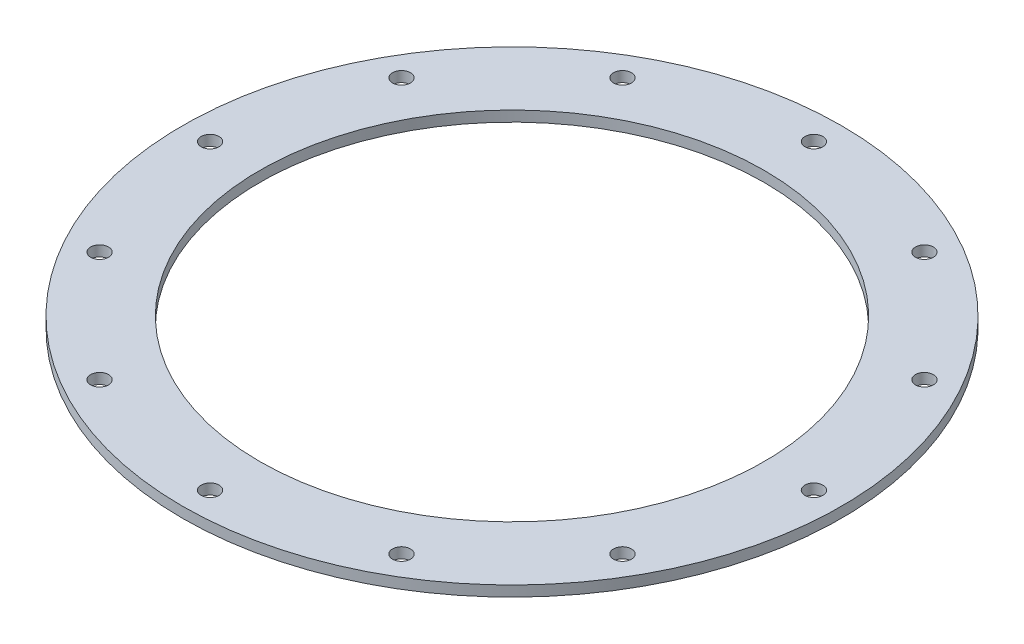
ISO-10303-21;
HEADER;
FILE_DESCRIPTION(('STEP AP214'),'2;1');
FILE_NAME('part.step','',(''),(''),'','','');
FILE_SCHEMA(('AUTOMOTIVE_DESIGN { 1 0 10303 214 1 1 1 1 }'));
ENDSEC;
DATA;
#1=APPLICATION_CONTEXT('core data for automotive mechanical design processes');
#2=APPLICATION_PROTOCOL_DEFINITION('international standard','automotive_design',2000,#1);
#3=PRODUCT_CONTEXT('',#1,'mechanical');
#4=PRODUCT('Part','Part','',(#3));
#5=PRODUCT_RELATED_PRODUCT_CATEGORY('part','',(#4));
#6=PRODUCT_DEFINITION_FORMATION('','',#4);
#7=PRODUCT_DEFINITION_CONTEXT('part definition',#1,'design');
#8=PRODUCT_DEFINITION('design','',#6,#7);
#9=PRODUCT_DEFINITION_SHAPE('','',#8);
#10=(LENGTH_UNIT() NAMED_UNIT(*) SI_UNIT(.MILLI.,.METRE.));
#11=(NAMED_UNIT(*) PLANE_ANGLE_UNIT() SI_UNIT($,.RADIAN.));
#12=(NAMED_UNIT(*) SI_UNIT($,.STERADIAN.) SOLID_ANGLE_UNIT());
#13=UNCERTAINTY_MEASURE_WITH_UNIT(LENGTH_MEASURE(1.E-05),#10,'distance_accuracy_value','');
#14=(GEOMETRIC_REPRESENTATION_CONTEXT(3) GLOBAL_UNCERTAINTY_ASSIGNED_CONTEXT((#13)) GLOBAL_UNIT_ASSIGNED_CONTEXT((#10,
#11,#12)) REPRESENTATION_CONTEXT('',''));
#15=CARTESIAN_POINT('',(0.,0.,0.));
#16=DIRECTION('',(0.,0.,1.));
#17=DIRECTION('',(1.,0.,0.));
#18=AXIS2_PLACEMENT_3D('',#15,#16,#17);
#19=CARTESIAN_POINT('',(-38.1,1.5875,0.));
#20=DIRECTION('',(0.,1.,0.));
#21=DIRECTION('',(0.,0.,1.));
#22=AXIS2_PLACEMENT_3D('',#19,#20,#21);
#23=PLANE('',#22);
#24=CARTESIAN_POINT('',(-39.4956947573722,1.58750000000001,22.8028499999996));
#25=DIRECTION('',(0.,-1.,0.));
#26=DIRECTION('',(0.,0.,-1.));
#27=AXIS2_PLACEMENT_3D('',#24,#25,#26);
#28=CIRCLE('',#27,1.35255);
#29=CARTESIAN_POINT('',(-39.4956947573722,1.58750000000001,21.4502999999996));
#30=VERTEX_POINT('',#29);
#31=EDGE_CURVE('E119',#30,#30,#28,.T.);
#32=ORIENTED_EDGE('',*,*,#31,.T.);
#33=EDGE_LOOP('',(#32));
#34=FACE_BOUND('',#33,.T.);
#35=CARTESIAN_POINT('',(-22.8028500000004,1.58750000000001,39.4956947573717));
#36=DIRECTION('',(0.,-1.,0.));
#37=DIRECTION('',(0.,0.,-1.));
#38=AXIS2_PLACEMENT_3D('',#35,#36,#37);
#39=CIRCLE('',#38,1.35255);
#40=CARTESIAN_POINT('',(-22.8028500000004,1.58750000000001,38.1431447573717));
#41=VERTEX_POINT('',#40);
#42=EDGE_CURVE('E113',#41,#41,#39,.T.);
#43=ORIENTED_EDGE('',*,*,#42,.T.);
#44=EDGE_LOOP('',(#43));
#45=FACE_BOUND('',#44,.T.);
#46=CARTESIAN_POINT('',(-3.91097266921211E-13,1.58750000000001,45.6057));
#47=DIRECTION('',(0.,-1.,0.));
#48=DIRECTION('',(0.,0.,-1.));
#49=AXIS2_PLACEMENT_3D('',#46,#47,#48);
#50=CIRCLE('',#49,1.35255);
#51=CARTESIAN_POINT('',(-3.91097266921211E-13,1.58750000000001,44.25315));
#52=VERTEX_POINT('',#51);
#53=EDGE_CURVE('E107',#52,#52,#50,.T.);
#54=ORIENTED_EDGE('',*,*,#53,.T.);
#55=EDGE_LOOP('',(#54));
#56=FACE_BOUND('',#55,.T.);
#57=CARTESIAN_POINT('',(45.6057,1.58750000000001,2.52118815703992E-13));
#58=DIRECTION('',(0.,-1.,0.));
#59=DIRECTION('',(0.,0.,-1.));
#60=AXIS2_PLACEMENT_3D('',#57,#58,#59);
#61=CIRCLE('',#60,1.35255);
#62=CARTESIAN_POINT('',(45.6057,1.58750000000001,-1.35254999999975));
#63=VERTEX_POINT('',#62);
#64=EDGE_CURVE('E89',#63,#63,#61,.T.);
#65=ORIENTED_EDGE('',*,*,#64,.T.);
#66=EDGE_LOOP('',(#65));
#67=FACE_BOUND('',#66,.T.);
#68=CARTESIAN_POINT('',(39.4956947573721,1.58750000000001,-22.8028499999998));
#69=DIRECTION('',(0.,-1.,0.));
#70=DIRECTION('',(0.,0.,-1.));
#71=AXIS2_PLACEMENT_3D('',#68,#69,#70);
#72=CIRCLE('',#71,1.35255);
#73=CARTESIAN_POINT('',(39.4956947573721,1.58750000000001,-24.1553999999998));
#74=VERTEX_POINT('',#73);
#75=EDGE_CURVE('E83',#74,#74,#72,.T.);
#76=ORIENTED_EDGE('',*,*,#75,.T.);
#77=EDGE_LOOP('',(#76));
#78=FACE_BOUND('',#77,.T.);
#79=CARTESIAN_POINT('',(22.8028500000001,1.58750000000001,-39.4956947573719));
#80=DIRECTION('',(0.,-1.,0.));
#81=DIRECTION('',(0.,0.,-1.));
#82=AXIS2_PLACEMENT_3D('',#79,#80,#81);
#83=CIRCLE('',#82,1.35255);
#84=CARTESIAN_POINT('',(22.8028500000001,1.58750000000001,-40.8482447573719));
#85=VERTEX_POINT('',#84);
#86=EDGE_CURVE('E77',#85,#85,#83,.T.);
#87=ORIENTED_EDGE('',*,*,#86,.T.);
#88=EDGE_LOOP('',(#87));
#89=FACE_BOUND('',#88,.T.);
#90=CARTESIAN_POINT('',(1.23266864125602E-13,1.58750000000001,-45.6057));
#91=DIRECTION('',(0.,-1.,0.));
#92=DIRECTION('',(0.,0.,-1.));
#93=AXIS2_PLACEMENT_3D('',#90,#91,#92);
#94=CIRCLE('',#93,1.35255);
#95=CARTESIAN_POINT('',(1.23266864125602E-13,1.58750000000001,-46.95825));
#96=VERTEX_POINT('',#95);
#97=EDGE_CURVE('E71',#96,#96,#94,.T.);
#98=ORIENTED_EDGE('',*,*,#97,.T.);
#99=EDGE_LOOP('',(#98));
#100=FACE_BOUND('',#99,.T.);
#101=CARTESIAN_POINT('',(-39.495694757372,1.58750000000001,-22.80285));
#102=DIRECTION('',(0.,-1.,0.));
#103=DIRECTION('',(0.,0.,-1.));
#104=AXIS2_PLACEMENT_3D('',#101,#102,#103);
#105=CIRCLE('',#104,1.35255);
#106=CARTESIAN_POINT('',(-39.495694757372,1.58750000000001,-24.1554));
#107=VERTEX_POINT('',#106);
#108=EDGE_CURVE('E59',#107,#107,#105,.T.);
#109=ORIENTED_EDGE('',*,*,#108,.T.);
#110=EDGE_LOOP('',(#109));
#111=FACE_BOUND('',#110,.T.);
#112=CARTESIAN_POINT('',(-45.6057,1.58750000000001,0.));
#113=DIRECTION('',(0.,-1.,0.));
#114=DIRECTION('',(0.,0.,-1.));
#115=AXIS2_PLACEMENT_3D('',#112,#113,#114);
#116=CIRCLE('',#115,1.35255);
#117=CARTESIAN_POINT('',(-45.6057,1.58750000000001,-1.35255));
#118=VERTEX_POINT('',#117);
#119=EDGE_CURVE('E53',#118,#118,#116,.T.);
#120=ORIENTED_EDGE('',*,*,#119,.T.);
#121=EDGE_LOOP('',(#120));
#122=FACE_BOUND('',#121,.T.);
#123=CARTESIAN_POINT('',(0.,1.5875,0.));
#124=DIRECTION('',(0.,1.,0.));
#125=DIRECTION('',(0.,0.,1.));
#126=AXIS2_PLACEMENT_3D('',#123,#124,#125);
#127=CIRCLE('',#126,49.784);
#128=CARTESIAN_POINT('',(0.,1.5875,49.784));
#129=VERTEX_POINT('',#128);
#130=EDGE_CURVE('E40',#129,#129,#127,.T.);
#131=ORIENTED_EDGE('',*,*,#130,.T.);
#132=EDGE_LOOP('',(#131));
#133=FACE_BOUND('',#132,.T.);
#134=CARTESIAN_POINT('',(0.,1.5875,0.));
#135=DIRECTION('',(0.,1.,0.));
#136=DIRECTION('',(0.,0.,1.));
#137=AXIS2_PLACEMENT_3D('',#134,#135,#136);
#138=CIRCLE('',#137,38.1);
#139=CARTESIAN_POINT('',(0.,1.5875,38.1));
#140=VERTEX_POINT('',#139);
#141=EDGE_CURVE('E10',#140,#140,#138,.T.);
#142=ORIENTED_EDGE('',*,*,#141,.F.);
#143=EDGE_LOOP('',(#142));
#144=FACE_BOUND('',#143,.T.);
#145=CARTESIAN_POINT('',(-22.8028499999999,1.58750000000001,-39.495694757372));
#146=DIRECTION('',(0.,-1.,0.));
#147=DIRECTION('',(0.,0.,-1.));
#148=AXIS2_PLACEMENT_3D('',#145,#146,#147);
#149=CIRCLE('',#148,1.35255);
#150=CARTESIAN_POINT('',(-22.8028499999999,1.58750000000001,-40.848244757372));
#151=VERTEX_POINT('',#150);
#152=EDGE_CURVE('E65',#151,#151,#149,.T.);
#153=ORIENTED_EDGE('',*,*,#152,.T.);
#154=EDGE_LOOP('',(#153));
#155=FACE_BOUND('',#154,.T.);
#156=CARTESIAN_POINT('',(39.4956947573718,1.58750000000001,22.8028500000002));
#157=DIRECTION('',(0.,-1.,0.));
#158=DIRECTION('',(0.,0.,-1.));
#159=AXIS2_PLACEMENT_3D('',#156,#157,#158);
#160=CIRCLE('',#159,1.35255);
#161=CARTESIAN_POINT('',(39.4956947573718,1.58750000000001,21.4503000000002));
#162=VERTEX_POINT('',#161);
#163=EDGE_CURVE('E95',#162,#162,#160,.T.);
#164=ORIENTED_EDGE('',*,*,#163,.T.);
#165=EDGE_LOOP('',(#164));
#166=FACE_BOUND('',#165,.T.);
#167=CARTESIAN_POINT('',(22.8028499999997,1.58750000000001,39.4956947573722));
#168=DIRECTION('',(0.,-1.,0.));
#169=DIRECTION('',(0.,0.,-1.));
#170=AXIS2_PLACEMENT_3D('',#167,#168,#169);
#171=CIRCLE('',#170,1.35255);
#172=CARTESIAN_POINT('',(22.8028499999997,1.58750000000001,38.1431447573722));
#173=VERTEX_POINT('',#172);
#174=EDGE_CURVE('E101',#173,#173,#171,.T.);
#175=ORIENTED_EDGE('',*,*,#174,.T.);
#176=EDGE_LOOP('',(#175));
#177=FACE_BOUND('',#176,.T.);
#178=ADVANCED_FACE('F33',(#34,#45,#56,#67,#78,#89,#100,#111,#122,#133,#144,#155,#166,#177),#23,.T.);
#179=CARTESIAN_POINT('',(0.,55.,0.));
#180=DIRECTION('',(0.,1.,0.));
#181=DIRECTION('',(0.,0.,1.));
#182=AXIS2_PLACEMENT_3D('',#179,#180,#181);
#183=CYLINDRICAL_SURFACE('',#182,38.1);
#184=ORIENTED_EDGE('',*,*,#141,.T.);
#185=EDGE_LOOP('',(#184));
#186=FACE_BOUND('',#185,.T.);
#187=CARTESIAN_POINT('',(0.,0.,0.));
#188=DIRECTION('',(0.,1.,0.));
#189=DIRECTION('',(0.,0.,1.));
#190=AXIS2_PLACEMENT_3D('',#187,#188,#189);
#191=CIRCLE('',#190,38.1);
#192=CARTESIAN_POINT('',(0.,0.,38.1));
#193=VERTEX_POINT('',#192);
#194=EDGE_CURVE('E48',#193,#193,#191,.T.);
#195=ORIENTED_EDGE('',*,*,#194,.F.);
#196=EDGE_LOOP('',(#195));
#197=FACE_BOUND('',#196,.T.);
#198=ADVANCED_FACE('F35',(#186,#197),#183,.F.);
#199=CARTESIAN_POINT('',(0.,55.,0.));
#200=DIRECTION('',(0.,1.,0.));
#201=DIRECTION('',(0.,0.,1.));
#202=AXIS2_PLACEMENT_3D('',#199,#200,#201);
#203=CYLINDRICAL_SURFACE('',#202,49.784);
#204=CARTESIAN_POINT('',(0.,0.,0.));
#205=DIRECTION('',(0.,1.,0.));
#206=DIRECTION('',(0.,0.,1.));
#207=AXIS2_PLACEMENT_3D('',#204,#205,#206);
#208=CIRCLE('',#207,49.784);
#209=CARTESIAN_POINT('',(0.,0.,49.784));
#210=VERTEX_POINT('',#209);
#211=EDGE_CURVE('E44',#210,#210,#208,.T.);
#212=ORIENTED_EDGE('',*,*,#211,.T.);
#213=EDGE_LOOP('',(#212));
#214=FACE_BOUND('',#213,.T.);
#215=ORIENTED_EDGE('',*,*,#130,.F.);
#216=EDGE_LOOP('',(#215));
#217=FACE_BOUND('',#216,.T.);
#218=ADVANCED_FACE('F132',(#214,#217),#203,.T.);
#219=CARTESIAN_POINT('',(-38.1,0.,0.));
#220=DIRECTION('',(0.,-1.,0.));
#221=DIRECTION('',(0.,0.,-1.));
#222=AXIS2_PLACEMENT_3D('',#219,#220,#221);
#223=PLANE('',#222);
#224=CARTESIAN_POINT('',(-39.4956947573722,0.,22.8028499999996));
#225=DIRECTION('',(0.,-1.,0.));
#226=DIRECTION('',(0.,0.,-1.));
#227=AXIS2_PLACEMENT_3D('',#224,#225,#226);
#228=CIRCLE('',#227,1.35255);
#229=CARTESIAN_POINT('',(-39.4956947573722,0.,21.4502999999996));
#230=VERTEX_POINT('',#229);
#231=EDGE_CURVE('E122',#230,#230,#228,.T.);
#232=ORIENTED_EDGE('',*,*,#231,.F.);
#233=EDGE_LOOP('',(#232));
#234=FACE_BOUND('',#233,.T.);
#235=CARTESIAN_POINT('',(-22.8028500000004,0.,39.4956947573717));
#236=DIRECTION('',(0.,-1.,0.));
#237=DIRECTION('',(0.,0.,-1.));
#238=AXIS2_PLACEMENT_3D('',#235,#236,#237);
#239=CIRCLE('',#238,1.35255);
#240=CARTESIAN_POINT('',(-22.8028500000004,0.,38.1431447573717));
#241=VERTEX_POINT('',#240);
#242=EDGE_CURVE('E116',#241,#241,#239,.T.);
#243=ORIENTED_EDGE('',*,*,#242,.F.);
#244=EDGE_LOOP('',(#243));
#245=FACE_BOUND('',#244,.T.);
#246=CARTESIAN_POINT('',(-3.91097266921211E-13,0.,45.6057));
#247=DIRECTION('',(0.,-1.,0.));
#248=DIRECTION('',(0.,0.,-1.));
#249=AXIS2_PLACEMENT_3D('',#246,#247,#248);
#250=CIRCLE('',#249,1.35255);
#251=CARTESIAN_POINT('',(-3.91097266921211E-13,0.,44.25315));
#252=VERTEX_POINT('',#251);
#253=EDGE_CURVE('E110',#252,#252,#250,.T.);
#254=ORIENTED_EDGE('',*,*,#253,.F.);
#255=EDGE_LOOP('',(#254));
#256=FACE_BOUND('',#255,.T.);
#257=CARTESIAN_POINT('',(22.8028499999997,0.,39.4956947573722));
#258=DIRECTION('',(0.,-1.,0.));
#259=DIRECTION('',(0.,0.,-1.));
#260=AXIS2_PLACEMENT_3D('',#257,#258,#259);
#261=CIRCLE('',#260,1.35255);
#262=CARTESIAN_POINT('',(22.8028499999997,0.,38.1431447573722));
#263=VERTEX_POINT('',#262);
#264=EDGE_CURVE('E104',#263,#263,#261,.T.);
#265=ORIENTED_EDGE('',*,*,#264,.F.);
#266=EDGE_LOOP('',(#265));
#267=FACE_BOUND('',#266,.T.);
#268=CARTESIAN_POINT('',(39.4956947573718,0.,22.8028500000002));
#269=DIRECTION('',(0.,-1.,0.));
#270=DIRECTION('',(0.,0.,-1.));
#271=AXIS2_PLACEMENT_3D('',#268,#269,#270);
#272=CIRCLE('',#271,1.35255);
#273=CARTESIAN_POINT('',(39.4956947573718,0.,21.4503000000002));
#274=VERTEX_POINT('',#273);
#275=EDGE_CURVE('E98',#274,#274,#272,.T.);
#276=ORIENTED_EDGE('',*,*,#275,.F.);
#277=EDGE_LOOP('',(#276));
#278=FACE_BOUND('',#277,.T.);
#279=CARTESIAN_POINT('',(45.6057,0.,2.52118815703992E-13));
#280=DIRECTION('',(0.,-1.,0.));
#281=DIRECTION('',(0.,0.,-1.));
#282=AXIS2_PLACEMENT_3D('',#279,#280,#281);
#283=CIRCLE('',#282,1.35255);
#284=CARTESIAN_POINT('',(45.6057,0.,-1.35254999999975));
#285=VERTEX_POINT('',#284);
#286=EDGE_CURVE('E92',#285,#285,#283,.T.);
#287=ORIENTED_EDGE('',*,*,#286,.F.);
#288=EDGE_LOOP('',(#287));
#289=FACE_BOUND('',#288,.T.);
#290=CARTESIAN_POINT('',(39.4956947573721,0.,-22.8028499999998));
#291=DIRECTION('',(0.,-1.,0.));
#292=DIRECTION('',(0.,0.,-1.));
#293=AXIS2_PLACEMENT_3D('',#290,#291,#292);
#294=CIRCLE('',#293,1.35255);
#295=CARTESIAN_POINT('',(39.4956947573721,0.,-24.1553999999998));
#296=VERTEX_POINT('',#295);
#297=EDGE_CURVE('E86',#296,#296,#294,.T.);
#298=ORIENTED_EDGE('',*,*,#297,.F.);
#299=EDGE_LOOP('',(#298));
#300=FACE_BOUND('',#299,.T.);
#301=CARTESIAN_POINT('',(22.8028500000001,0.,-39.4956947573719));
#302=DIRECTION('',(0.,-1.,0.));
#303=DIRECTION('',(0.,0.,-1.));
#304=AXIS2_PLACEMENT_3D('',#301,#302,#303);
#305=CIRCLE('',#304,1.35255);
#306=CARTESIAN_POINT('',(22.8028500000001,0.,-40.8482447573719));
#307=VERTEX_POINT('',#306);
#308=EDGE_CURVE('E80',#307,#307,#305,.T.);
#309=ORIENTED_EDGE('',*,*,#308,.F.);
#310=EDGE_LOOP('',(#309));
#311=FACE_BOUND('',#310,.T.);
#312=CARTESIAN_POINT('',(1.23266864125602E-13,0.,-45.6057));
#313=DIRECTION('',(0.,-1.,0.));
#314=DIRECTION('',(0.,0.,-1.));
#315=AXIS2_PLACEMENT_3D('',#312,#313,#314);
#316=CIRCLE('',#315,1.35255);
#317=CARTESIAN_POINT('',(1.23266864125602E-13,0.,-46.95825));
#318=VERTEX_POINT('',#317);
#319=EDGE_CURVE('E74',#318,#318,#316,.T.);
#320=ORIENTED_EDGE('',*,*,#319,.F.);
#321=EDGE_LOOP('',(#320));
#322=FACE_BOUND('',#321,.T.);
#323=CARTESIAN_POINT('',(-22.8028499999999,0.,-39.495694757372));
#324=DIRECTION('',(0.,-1.,0.));
#325=DIRECTION('',(0.,0.,-1.));
#326=AXIS2_PLACEMENT_3D('',#323,#324,#325);
#327=CIRCLE('',#326,1.35255);
#328=CARTESIAN_POINT('',(-22.8028499999999,0.,-40.848244757372));
#329=VERTEX_POINT('',#328);
#330=EDGE_CURVE('E68',#329,#329,#327,.T.);
#331=ORIENTED_EDGE('',*,*,#330,.F.);
#332=EDGE_LOOP('',(#331));
#333=FACE_BOUND('',#332,.T.);
#334=CARTESIAN_POINT('',(-39.495694757372,0.,-22.80285));
#335=DIRECTION('',(0.,-1.,0.));
#336=DIRECTION('',(0.,0.,-1.));
#337=AXIS2_PLACEMENT_3D('',#334,#335,#336);
#338=CIRCLE('',#337,1.35255);
#339=CARTESIAN_POINT('',(-39.495694757372,0.,-24.1554));
#340=VERTEX_POINT('',#339);
#341=EDGE_CURVE('E62',#340,#340,#338,.T.);
#342=ORIENTED_EDGE('',*,*,#341,.F.);
#343=EDGE_LOOP('',(#342));
#344=FACE_BOUND('',#343,.T.);
#345=CARTESIAN_POINT('',(-45.6057,0.,0.));
#346=DIRECTION('',(0.,-1.,0.));
#347=DIRECTION('',(0.,0.,-1.));
#348=AXIS2_PLACEMENT_3D('',#345,#346,#347);
#349=CIRCLE('',#348,1.35255);
#350=CARTESIAN_POINT('',(-45.6057,0.,-1.35255));
#351=VERTEX_POINT('',#350);
#352=EDGE_CURVE('E56',#351,#351,#349,.T.);
#353=ORIENTED_EDGE('',*,*,#352,.F.);
#354=EDGE_LOOP('',(#353));
#355=FACE_BOUND('',#354,.T.);
#356=ORIENTED_EDGE('',*,*,#194,.T.);
#357=EDGE_LOOP('',(#356));
#358=FACE_BOUND('',#357,.T.);
#359=ORIENTED_EDGE('',*,*,#211,.F.);
#360=EDGE_LOOP('',(#359));
#361=FACE_BOUND('',#360,.T.);
#362=ADVANCED_FACE('F128',(#234,#245,#256,#267,#278,#289,#300,#311,#322,#333,#344,#355,#358,
#361),#223,.T.);
#363=CARTESIAN_POINT('',(-45.6057,0.,0.));
#364=DIRECTION('',(0.,-1.,0.));
#365=DIRECTION('',(0.,0.,-1.));
#366=AXIS2_PLACEMENT_3D('',#363,#364,#365);
#367=CYLINDRICAL_SURFACE('',#366,1.35255);
#368=ORIENTED_EDGE('',*,*,#119,.F.);
#369=EDGE_LOOP('',(#368));
#370=FACE_BOUND('',#369,.T.);
#371=ORIENTED_EDGE('',*,*,#352,.T.);
#372=EDGE_LOOP('',(#371));
#373=FACE_BOUND('',#372,.T.);
#374=ADVANCED_FACE('F131',(#370,#373),#367,.F.);
#375=CARTESIAN_POINT('',(-39.495694757372,0.,-22.80285));
#376=DIRECTION('',(0.,-1.,0.));
#377=DIRECTION('',(0.,0.,-1.));
#378=AXIS2_PLACEMENT_3D('',#375,#376,#377);
#379=CYLINDRICAL_SURFACE('',#378,1.35255);
#380=ORIENTED_EDGE('',*,*,#108,.F.);
#381=EDGE_LOOP('',(#380));
#382=FACE_BOUND('',#381,.T.);
#383=ORIENTED_EDGE('',*,*,#341,.T.);
#384=EDGE_LOOP('',(#383));
#385=FACE_BOUND('',#384,.T.);
#386=ADVANCED_FACE('F231',(#382,#385),#379,.F.);
#387=CARTESIAN_POINT('',(-22.8028499999999,0.,-39.495694757372));
#388=DIRECTION('',(0.,-1.,0.));
#389=DIRECTION('',(0.,0.,-1.));
#390=AXIS2_PLACEMENT_3D('',#387,#388,#389);
#391=CYLINDRICAL_SURFACE('',#390,1.35255);
#392=ORIENTED_EDGE('',*,*,#152,.F.);
#393=EDGE_LOOP('',(#392));
#394=FACE_BOUND('',#393,.T.);
#395=ORIENTED_EDGE('',*,*,#330,.T.);
#396=EDGE_LOOP('',(#395));
#397=FACE_BOUND('',#396,.T.);
#398=ADVANCED_FACE('F227',(#394,#397),#391,.F.);
#399=CARTESIAN_POINT('',(1.23266864125602E-13,0.,-45.6057));
#400=DIRECTION('',(0.,-1.,0.));
#401=DIRECTION('',(0.,0.,-1.));
#402=AXIS2_PLACEMENT_3D('',#399,#400,#401);
#403=CYLINDRICAL_SURFACE('',#402,1.35255);
#404=ORIENTED_EDGE('',*,*,#97,.F.);
#405=EDGE_LOOP('',(#404));
#406=FACE_BOUND('',#405,.T.);
#407=ORIENTED_EDGE('',*,*,#319,.T.);
#408=EDGE_LOOP('',(#407));
#409=FACE_BOUND('',#408,.T.);
#410=ADVANCED_FACE('F223',(#406,#409),#403,.F.);
#411=CARTESIAN_POINT('',(22.8028500000001,0.,-39.4956947573719));
#412=DIRECTION('',(0.,-1.,0.));
#413=DIRECTION('',(0.,0.,-1.));
#414=AXIS2_PLACEMENT_3D('',#411,#412,#413);
#415=CYLINDRICAL_SURFACE('',#414,1.35255);
#416=ORIENTED_EDGE('',*,*,#86,.F.);
#417=EDGE_LOOP('',(#416));
#418=FACE_BOUND('',#417,.T.);
#419=ORIENTED_EDGE('',*,*,#308,.T.);
#420=EDGE_LOOP('',(#419));
#421=FACE_BOUND('',#420,.T.);
#422=ADVANCED_FACE('F219',(#418,#421),#415,.F.);
#423=CARTESIAN_POINT('',(39.4956947573721,0.,-22.8028499999998));
#424=DIRECTION('',(0.,-1.,0.));
#425=DIRECTION('',(0.,0.,-1.));
#426=AXIS2_PLACEMENT_3D('',#423,#424,#425);
#427=CYLINDRICAL_SURFACE('',#426,1.35255);
#428=ORIENTED_EDGE('',*,*,#75,.F.);
#429=EDGE_LOOP('',(#428));
#430=FACE_BOUND('',#429,.T.);
#431=ORIENTED_EDGE('',*,*,#297,.T.);
#432=EDGE_LOOP('',(#431));
#433=FACE_BOUND('',#432,.T.);
#434=ADVANCED_FACE('F215',(#430,#433),#427,.F.);
#435=CARTESIAN_POINT('',(45.6057,0.,2.52118815703992E-13));
#436=DIRECTION('',(0.,-1.,0.));
#437=DIRECTION('',(0.,0.,-1.));
#438=AXIS2_PLACEMENT_3D('',#435,#436,#437);
#439=CYLINDRICAL_SURFACE('',#438,1.35255);
#440=ORIENTED_EDGE('',*,*,#64,.F.);
#441=EDGE_LOOP('',(#440));
#442=FACE_BOUND('',#441,.T.);
#443=ORIENTED_EDGE('',*,*,#286,.T.);
#444=EDGE_LOOP('',(#443));
#445=FACE_BOUND('',#444,.T.);
#446=ADVANCED_FACE('F208',(#442,#445),#439,.F.);
#447=CARTESIAN_POINT('',(39.4956947573718,0.,22.8028500000002));
#448=DIRECTION('',(0.,-1.,0.));
#449=DIRECTION('',(0.,0.,-1.));
#450=AXIS2_PLACEMENT_3D('',#447,#448,#449);
#451=CYLINDRICAL_SURFACE('',#450,1.35255);
#452=ORIENTED_EDGE('',*,*,#163,.F.);
#453=EDGE_LOOP('',(#452));
#454=FACE_BOUND('',#453,.T.);
#455=ORIENTED_EDGE('',*,*,#275,.T.);
#456=EDGE_LOOP('',(#455));
#457=FACE_BOUND('',#456,.T.);
#458=ADVANCED_FACE('F199',(#454,#457),#451,.F.);
#459=CARTESIAN_POINT('',(22.8028499999997,0.,39.4956947573722));
#460=DIRECTION('',(0.,-1.,0.));
#461=DIRECTION('',(0.,0.,-1.));
#462=AXIS2_PLACEMENT_3D('',#459,#460,#461);
#463=CYLINDRICAL_SURFACE('',#462,1.35255);
#464=ORIENTED_EDGE('',*,*,#174,.F.);
#465=EDGE_LOOP('',(#464));
#466=FACE_BOUND('',#465,.T.);
#467=ORIENTED_EDGE('',*,*,#264,.T.);
#468=EDGE_LOOP('',(#467));
#469=FACE_BOUND('',#468,.T.);
#470=ADVANCED_FACE('F195',(#466,#469),#463,.F.);
#471=CARTESIAN_POINT('',(-3.91097266921211E-13,0.,45.6057));
#472=DIRECTION('',(0.,-1.,0.));
#473=DIRECTION('',(0.,0.,-1.));
#474=AXIS2_PLACEMENT_3D('',#471,#472,#473);
#475=CYLINDRICAL_SURFACE('',#474,1.35255);
#476=ORIENTED_EDGE('',*,*,#53,.F.);
#477=EDGE_LOOP('',(#476));
#478=FACE_BOUND('',#477,.T.);
#479=ORIENTED_EDGE('',*,*,#253,.T.);
#480=EDGE_LOOP('',(#479));
#481=FACE_BOUND('',#480,.T.);
#482=ADVANCED_FACE('F198',(#478,#481),#475,.F.);
#483=CARTESIAN_POINT('',(-22.8028500000004,0.,39.4956947573717));
#484=DIRECTION('',(0.,-1.,0.));
#485=DIRECTION('',(0.,0.,-1.));
#486=AXIS2_PLACEMENT_3D('',#483,#484,#485);
#487=CYLINDRICAL_SURFACE('',#486,1.35255);
#488=ORIENTED_EDGE('',*,*,#42,.F.);
#489=EDGE_LOOP('',(#488));
#490=FACE_BOUND('',#489,.T.);
#491=ORIENTED_EDGE('',*,*,#242,.T.);
#492=EDGE_LOOP('',(#491));
#493=FACE_BOUND('',#492,.T.);
#494=ADVANCED_FACE('F205',(#490,#493),#487,.F.);
#495=CARTESIAN_POINT('',(-39.4956947573722,0.,22.8028499999996));
#496=DIRECTION('',(0.,-1.,0.));
#497=DIRECTION('',(0.,0.,-1.));
#498=AXIS2_PLACEMENT_3D('',#495,#496,#497);
#499=CYLINDRICAL_SURFACE('',#498,1.35255);
#500=ORIENTED_EDGE('',*,*,#31,.F.);
#501=EDGE_LOOP('',(#500));
#502=FACE_BOUND('',#501,.T.);
#503=ORIENTED_EDGE('',*,*,#231,.T.);
#504=EDGE_LOOP('',(#503));
#505=FACE_BOUND('',#504,.T.);
#506=ADVANCED_FACE('F126',(#502,#505),#499,.F.);
#507=CLOSED_SHELL('',(#178,#198,#218,#362,#374,#386,#398,#410,#422,#434,#446,#458,#470,#482,
#494,#506));
#508=MANIFOLD_SOLID_BREP('B2',#507);
#509=ADVANCED_BREP_SHAPE_REPRESENTATION('',(#18,#508),#14);
#510=SHAPE_DEFINITION_REPRESENTATION(#9,#509);
ENDSEC;
END-ISO-10303-21;
